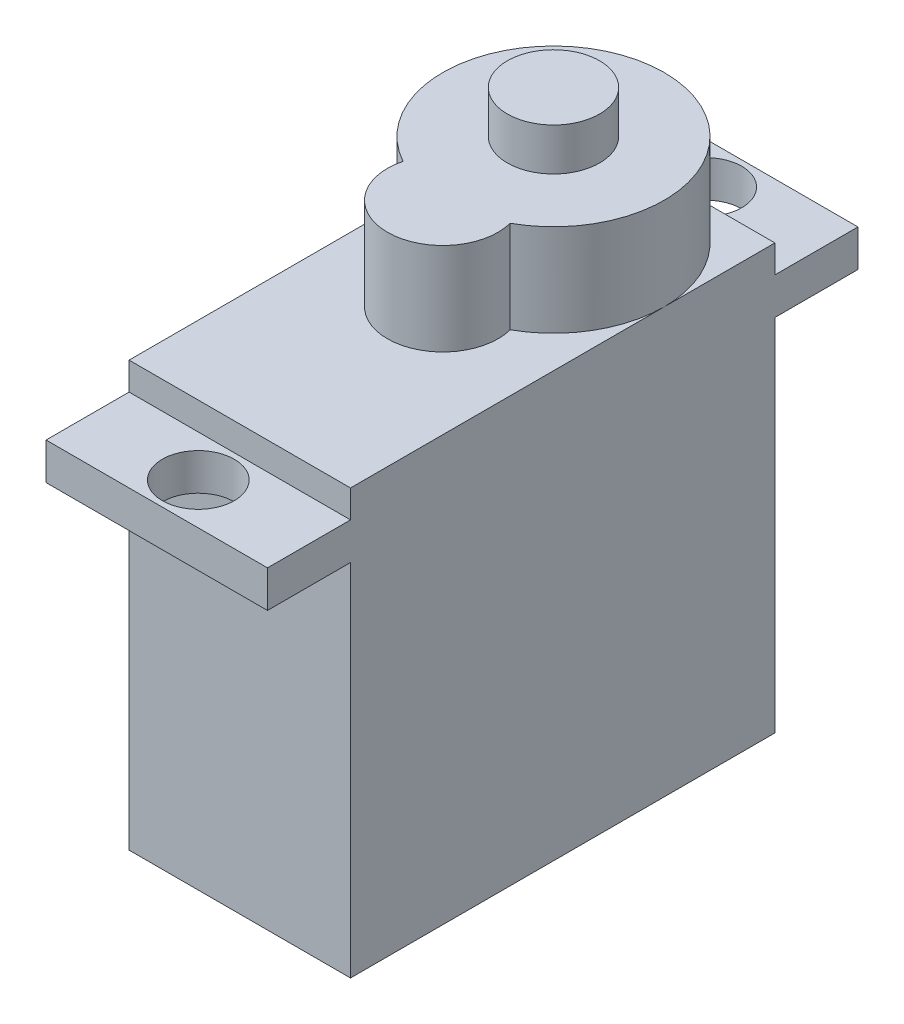
ISO-10303-21;
HEADER;
FILE_DESCRIPTION(('STEP AP214'),'2;1');
FILE_NAME('part.step','',(''),(''),'','','');
FILE_SCHEMA(('AUTOMOTIVE_DESIGN { 1 0 10303 214 1 1 1 1 }'));
ENDSEC;
DATA;
#1=APPLICATION_CONTEXT('core data for automotive mechanical design processes');
#2=APPLICATION_PROTOCOL_DEFINITION('international standard','automotive_design',2000,#1);
#3=PRODUCT_CONTEXT('',#1,'mechanical');
#4=PRODUCT('Part','Part','',(#3));
#5=PRODUCT_RELATED_PRODUCT_CATEGORY('part','',(#4));
#6=PRODUCT_DEFINITION_FORMATION('','',#4);
#7=PRODUCT_DEFINITION_CONTEXT('part definition',#1,'design');
#8=PRODUCT_DEFINITION('design','',#6,#7);
#9=PRODUCT_DEFINITION_SHAPE('','',#8);
#10=(LENGTH_UNIT() NAMED_UNIT(*) SI_UNIT(.MILLI.,.METRE.));
#11=(NAMED_UNIT(*) PLANE_ANGLE_UNIT() SI_UNIT($,.RADIAN.));
#12=(NAMED_UNIT(*) SI_UNIT($,.STERADIAN.) SOLID_ANGLE_UNIT());
#13=UNCERTAINTY_MEASURE_WITH_UNIT(LENGTH_MEASURE(1.E-05),#10,'distance_accuracy_value','');
#14=(GEOMETRIC_REPRESENTATION_CONTEXT(3) GLOBAL_UNCERTAINTY_ASSIGNED_CONTEXT((#13)) GLOBAL_UNIT_ASSIGNED_CONTEXT((#10,
#11,#12)) REPRESENTATION_CONTEXT('',''));
#15=CARTESIAN_POINT('',(0.,0.,0.));
#16=DIRECTION('',(0.,0.,1.));
#17=DIRECTION('',(1.,0.,0.));
#18=AXIS2_PLACEMENT_3D('',#15,#16,#17);
#19=CARTESIAN_POINT('',(0.,3.5,0.));
#20=DIRECTION('',(0.,1.,0.));
#21=DIRECTION('',(0.,0.,1.));
#22=AXIS2_PLACEMENT_3D('',#19,#20,#21);
#23=PLANE('',#22);
#24=CARTESIAN_POINT('',(0.,3.5,6.));
#25=DIRECTION('',(0.,1.,0.));
#26=DIRECTION('',(0.,0.,1.));
#27=AXIS2_PLACEMENT_3D('',#24,#25,#26);
#28=CIRCLE('',#27,3.);
#29=CARTESIAN_POINT('',(-2.90473750965557,3.5,5.25));
#30=VERTEX_POINT('',#29);
#31=CARTESIAN_POINT('',(2.90473750965556,3.5,5.25));
#32=VERTEX_POINT('',#31);
#33=EDGE_CURVE('E161',#30,#32,#28,.T.);
#34=ORIENTED_EDGE('',*,*,#33,.F.);
#35=CARTESIAN_POINT('',(0.,3.5,0.));
#36=DIRECTION('',(0.,1.,0.));
#37=DIRECTION('',(0.,0.,1.));
#38=AXIS2_PLACEMENT_3D('',#35,#36,#37);
#39=CIRCLE('',#38,6.);
#40=CARTESIAN_POINT('',(-6.,3.5,0.));
#41=VERTEX_POINT('',#40);
#42=EDGE_CURVE('E247',#41,#30,#39,.T.);
#43=ORIENTED_EDGE('',*,*,#42,.F.);
#44=DIRECTION('',(0.,0.,1.));
#45=VECTOR('',#44,1.);
#46=CARTESIAN_POINT('',(-6.,3.5,-6.));
#47=LINE('',#46,#45);
#48=CARTESIAN_POINT('',(-5.99999999999999,3.5,17.));
#49=VERTEX_POINT('',#48);
#50=EDGE_CURVE('E218',#41,#49,#47,.T.);
#51=ORIENTED_EDGE('',*,*,#50,.T.);
#52=DIRECTION('',(1.,0.,0.));
#53=VECTOR('',#52,1.);
#54=CARTESIAN_POINT('',(-5.99999999999999,3.5,17.));
#55=LINE('',#54,#53);
#56=CARTESIAN_POINT('',(6.00000000000001,3.5,17.));
#57=VERTEX_POINT('',#56);
#58=EDGE_CURVE('E221',#49,#57,#55,.T.);
#59=ORIENTED_EDGE('',*,*,#58,.T.);
#60=DIRECTION('',(0.,0.,-1.));
#61=VECTOR('',#60,1.);
#62=CARTESIAN_POINT('',(6.,3.5,-6.));
#63=LINE('',#62,#61);
#64=CARTESIAN_POINT('',(6.,3.5,0.));
#65=VERTEX_POINT('',#64);
#66=EDGE_CURVE('E224',#57,#65,#63,.T.);
#67=ORIENTED_EDGE('',*,*,#66,.T.);
#68=EDGE_CURVE('E43',#32,#65,#39,.T.);
#69=ORIENTED_EDGE('',*,*,#68,.F.);
#70=EDGE_LOOP('',(#34,#43,#51,#59,#67,#69));
#71=FACE_BOUND('',#70,.T.);
#72=ADVANCED_FACE('F32',(#71),#23,.T.);
#73=CARTESIAN_POINT('',(0.,3.5,-6.));
#74=VERTEX_POINT('',#73);
#75=EDGE_CURVE('E11',#65,#74,#39,.T.);
#76=ORIENTED_EDGE('',*,*,#75,.F.);
#77=CARTESIAN_POINT('',(6.,3.5,-6.));
#78=VERTEX_POINT('',#77);
#79=EDGE_CURVE('E223',#65,#78,#63,.T.);
#80=ORIENTED_EDGE('',*,*,#79,.T.);
#81=DIRECTION('',(-1.,0.,0.));
#82=VECTOR('',#81,1.);
#83=CARTESIAN_POINT('',(-6.,3.5,-6.));
#84=LINE('',#83,#82);
#85=EDGE_CURVE('E227',#78,#74,#84,.T.);
#86=ORIENTED_EDGE('',*,*,#85,.T.);
#87=EDGE_LOOP('',(#76,#80,#86));
#88=FACE_BOUND('',#87,.T.);
#89=ADVANCED_FACE('F287',(#88),#23,.T.);
#90=CARTESIAN_POINT('',(-5.99999999999999,3.5,17.));
#91=DIRECTION('',(0.,0.,-1.));
#92=DIRECTION('',(-1.,0.,0.));
#93=AXIS2_PLACEMENT_3D('',#90,#91,#92);
#94=PLANE('',#93);
#95=DIRECTION('',(1.,0.,0.));
#96=VECTOR('',#95,1.);
#97=CARTESIAN_POINT('',(-5.99999999999999,0.,17.));
#98=LINE('',#97,#96);
#99=CARTESIAN_POINT('',(-5.99999999999999,0.,17.));
#100=VERTEX_POINT('',#99);
#101=CARTESIAN_POINT('',(6.00000000000001,0.,17.));
#102=VERTEX_POINT('',#101);
#103=EDGE_CURVE('E201',#100,#102,#98,.T.);
#104=ORIENTED_EDGE('',*,*,#103,.F.);
#105=DIRECTION('',(0.,-1.,0.));
#106=VECTOR('',#105,1.);
#107=CARTESIAN_POINT('',(-5.99999999999999,3.5,17.));
#108=LINE('',#107,#106);
#109=CARTESIAN_POINT('',(-5.99999999999999,-19.5,17.));
#110=VERTEX_POINT('',#109);
#111=EDGE_CURVE('E241',#100,#110,#108,.T.);
#112=ORIENTED_EDGE('',*,*,#111,.T.);
#113=DIRECTION('',(1.,0.,0.));
#114=VECTOR('',#113,1.);
#115=CARTESIAN_POINT('',(-5.99999999999999,-19.5,17.));
#116=LINE('',#115,#114);
#117=CARTESIAN_POINT('',(6.00000000000001,-19.5,17.));
#118=VERTEX_POINT('',#117);
#119=EDGE_CURVE('E209',#110,#118,#116,.T.);
#120=ORIENTED_EDGE('',*,*,#119,.T.);
#121=DIRECTION('',(0.,-1.,0.));
#122=VECTOR('',#121,1.);
#123=CARTESIAN_POINT('',(6.00000000000001,3.5,17.));
#124=LINE('',#123,#122);
#125=EDGE_CURVE('E237',#102,#118,#124,.T.);
#126=ORIENTED_EDGE('',*,*,#125,.F.);
#127=EDGE_LOOP('',(#104,#112,#120,#126));
#128=FACE_BOUND('',#127,.T.);
#129=ADVANCED_FACE('F293',(#128),#94,.F.);
#130=CARTESIAN_POINT('',(-6.,3.5,-6.));
#131=DIRECTION('',(0.,0.,1.));
#132=DIRECTION('',(1.,0.,0.));
#133=AXIS2_PLACEMENT_3D('',#130,#131,#132);
#134=PLANE('',#133);
#135=DIRECTION('',(-1.,0.,0.));
#136=VECTOR('',#135,1.);
#137=CARTESIAN_POINT('',(-6.,0.,-6.));
#138=LINE('',#137,#136);
#139=CARTESIAN_POINT('',(6.,0.,-6.));
#140=VERTEX_POINT('',#139);
#141=CARTESIAN_POINT('',(-5.99999999999999,0.,-6.));
#142=VERTEX_POINT('',#141);
#143=EDGE_CURVE('E244',#140,#142,#138,.T.);
#144=ORIENTED_EDGE('',*,*,#143,.F.);
#145=DIRECTION('',(0.,-1.,0.));
#146=VECTOR('',#145,1.);
#147=CARTESIAN_POINT('',(6.,3.5,-6.));
#148=LINE('',#147,#146);
#149=CARTESIAN_POINT('',(6.,-19.5,-6.));
#150=VERTEX_POINT('',#149);
#151=EDGE_CURVE('E234',#140,#150,#148,.T.);
#152=ORIENTED_EDGE('',*,*,#151,.T.);
#153=DIRECTION('',(-1.,0.,0.));
#154=VECTOR('',#153,1.);
#155=CARTESIAN_POINT('',(-6.,-19.5,-6.));
#156=LINE('',#155,#154);
#157=CARTESIAN_POINT('',(-6.,-19.5,-6.));
#158=VERTEX_POINT('',#157);
#159=EDGE_CURVE('E215',#150,#158,#156,.T.);
#160=ORIENTED_EDGE('',*,*,#159,.T.);
#161=DIRECTION('',(0.,-1.,0.));
#162=VECTOR('',#161,1.);
#163=CARTESIAN_POINT('',(-6.,3.5,-6.));
#164=LINE('',#163,#162);
#165=EDGE_CURVE('E230',#142,#158,#164,.T.);
#166=ORIENTED_EDGE('',*,*,#165,.F.);
#167=EDGE_LOOP('',(#144,#152,#160,#166));
#168=FACE_BOUND('',#167,.T.);
#169=ADVANCED_FACE('F307',(#168),#134,.F.);
#170=CARTESIAN_POINT('',(-6.,3.5,-6.));
#171=DIRECTION('',(1.,0.,0.));
#172=DIRECTION('',(0.,0.,-1.));
#173=AXIS2_PLACEMENT_3D('',#170,#171,#172);
#174=PLANE('',#173);
#175=CARTESIAN_POINT('',(-6.,3.5,-6.));
#176=VERTEX_POINT('',#175);
#177=CARTESIAN_POINT('',(-6.,2.,-6.));
#178=VERTEX_POINT('',#177);
#179=EDGE_CURVE('E231',#176,#178,#164,.T.);
#180=ORIENTED_EDGE('',*,*,#179,.T.);
#181=DIRECTION('',(0.,0.,1.));
#182=VECTOR('',#181,1.);
#183=CARTESIAN_POINT('',(-5.99999999999999,2.,-10.5));
#184=LINE('',#183,#182);
#185=CARTESIAN_POINT('',(-5.99999999999999,2.,-10.5));
#186=VERTEX_POINT('',#185);
#187=EDGE_CURVE('E168',#186,#178,#184,.T.);
#188=ORIENTED_EDGE('',*,*,#187,.F.);
#189=DIRECTION('',(0.,-1.,0.));
#190=VECTOR('',#189,1.);
#191=CARTESIAN_POINT('',(-5.99999999999999,2.,-10.5));
#192=LINE('',#191,#190);
#193=CARTESIAN_POINT('',(-5.99999999999999,0.,-10.5));
#194=VERTEX_POINT('',#193);
#195=EDGE_CURVE('E179',#186,#194,#192,.T.);
#196=ORIENTED_EDGE('',*,*,#195,.T.);
#197=DIRECTION('',(0.,0.,1.));
#198=VECTOR('',#197,1.);
#199=CARTESIAN_POINT('',(-5.99999999999999,0.,-10.5));
#200=LINE('',#199,#198);
#201=EDGE_CURVE('E164',#194,#142,#200,.T.);
#202=ORIENTED_EDGE('',*,*,#201,.T.);
#203=ORIENTED_EDGE('',*,*,#165,.T.);
#204=DIRECTION('',(0.,0.,1.));
#205=VECTOR('',#204,1.);
#206=CARTESIAN_POINT('',(-6.,-19.5,-6.));
#207=LINE('',#206,#205);
#208=EDGE_CURVE('E206',#158,#110,#207,.T.);
#209=ORIENTED_EDGE('',*,*,#208,.T.);
#210=ORIENTED_EDGE('',*,*,#111,.F.);
#211=CARTESIAN_POINT('',(-5.99999999999999,0.,21.5));
#212=VERTEX_POINT('',#211);
#213=EDGE_CURVE('E162',#100,#212,#200,.T.);
#214=ORIENTED_EDGE('',*,*,#213,.T.);
#215=DIRECTION('',(0.,-1.,0.));
#216=VECTOR('',#215,1.);
#217=CARTESIAN_POINT('',(-5.99999999999999,2.,21.5));
#218=LINE('',#217,#216);
#219=CARTESIAN_POINT('',(-5.99999999999999,2.,21.5));
#220=VERTEX_POINT('',#219);
#221=EDGE_CURVE('E198',#220,#212,#218,.T.);
#222=ORIENTED_EDGE('',*,*,#221,.F.);
#223=CARTESIAN_POINT('',(-5.99999999999999,2.,17.));
#224=VERTEX_POINT('',#223);
#225=EDGE_CURVE('E172',#224,#220,#184,.T.);
#226=ORIENTED_EDGE('',*,*,#225,.F.);
#227=EDGE_CURVE('E242',#49,#224,#108,.T.);
#228=ORIENTED_EDGE('',*,*,#227,.F.);
#229=ORIENTED_EDGE('',*,*,#50,.F.);
#230=EDGE_CURVE('E219',#176,#41,#47,.T.);
#231=ORIENTED_EDGE('',*,*,#230,.F.);
#232=EDGE_LOOP('',(#180,#188,#196,#202,#203,#209,#210,#214,#222,#226,#228,#229,#231));
#233=FACE_BOUND('',#232,.T.);
#234=ADVANCED_FACE('F34',(#233),#174,.F.);
#235=ORIENTED_EDGE('',*,*,#227,.T.);
#236=DIRECTION('',(1.,0.,0.));
#237=VECTOR('',#236,1.);
#238=CARTESIAN_POINT('',(-5.99999999999999,2.,17.));
#239=LINE('',#238,#237);
#240=CARTESIAN_POINT('',(6.00000000000001,2.,17.));
#241=VERTEX_POINT('',#240);
#242=EDGE_CURVE('E204',#224,#241,#239,.T.);
#243=ORIENTED_EDGE('',*,*,#242,.T.);
#244=EDGE_CURVE('E238',#57,#241,#124,.T.);
#245=ORIENTED_EDGE('',*,*,#244,.F.);
#246=ORIENTED_EDGE('',*,*,#58,.F.);
#247=EDGE_LOOP('',(#235,#243,#245,#246));
#248=FACE_BOUND('',#247,.T.);
#249=ADVANCED_FACE('F311',(#248),#94,.F.);
#250=CARTESIAN_POINT('',(6.,3.5,-6.));
#251=DIRECTION('',(-1.,0.,0.));
#252=DIRECTION('',(0.,0.,1.));
#253=AXIS2_PLACEMENT_3D('',#250,#251,#252);
#254=PLANE('',#253);
#255=ORIENTED_EDGE('',*,*,#244,.T.);
#256=DIRECTION('',(0.,0.,-1.));
#257=VECTOR('',#256,1.);
#258=CARTESIAN_POINT('',(6.00000000000001,2.,-10.5));
#259=LINE('',#258,#257);
#260=CARTESIAN_POINT('',(6.00000000000001,2.,21.5));
#261=VERTEX_POINT('',#260);
#262=EDGE_CURVE('E175',#261,#241,#259,.T.);
#263=ORIENTED_EDGE('',*,*,#262,.F.);
#264=DIRECTION('',(0.,-1.,0.));
#265=VECTOR('',#264,1.);
#266=CARTESIAN_POINT('',(6.00000000000001,2.,21.5));
#267=LINE('',#266,#265);
#268=CARTESIAN_POINT('',(6.00000000000001,0.,21.5));
#269=VERTEX_POINT('',#268);
#270=EDGE_CURVE('E195',#261,#269,#267,.T.);
#271=ORIENTED_EDGE('',*,*,#270,.T.);
#272=DIRECTION('',(0.,0.,-1.));
#273=VECTOR('',#272,1.);
#274=CARTESIAN_POINT('',(6.00000000000001,0.,-10.5));
#275=LINE('',#274,#273);
#276=EDGE_CURVE('E185',#269,#102,#275,.T.);
#277=ORIENTED_EDGE('',*,*,#276,.T.);
#278=ORIENTED_EDGE('',*,*,#125,.T.);
#279=DIRECTION('',(0.,0.,-1.));
#280=VECTOR('',#279,1.);
#281=CARTESIAN_POINT('',(6.,-19.5,-6.));
#282=LINE('',#281,#280);
#283=EDGE_CURVE('E212',#118,#150,#282,.T.);
#284=ORIENTED_EDGE('',*,*,#283,.T.);
#285=ORIENTED_EDGE('',*,*,#151,.F.);
#286=CARTESIAN_POINT('',(6.00000000000001,0.,-10.5));
#287=VERTEX_POINT('',#286);
#288=EDGE_CURVE('E184',#140,#287,#275,.T.);
#289=ORIENTED_EDGE('',*,*,#288,.T.);
#290=DIRECTION('',(0.,-1.,0.));
#291=VECTOR('',#290,1.);
#292=CARTESIAN_POINT('',(6.00000000000001,2.,-10.5));
#293=LINE('',#292,#291);
#294=CARTESIAN_POINT('',(6.00000000000001,2.,-10.5));
#295=VERTEX_POINT('',#294);
#296=EDGE_CURVE('E192',#295,#287,#293,.T.);
#297=ORIENTED_EDGE('',*,*,#296,.F.);
#298=CARTESIAN_POINT('',(6.,2.,-6.));
#299=VERTEX_POINT('',#298);
#300=EDGE_CURVE('E174',#299,#295,#259,.T.);
#301=ORIENTED_EDGE('',*,*,#300,.F.);
#302=EDGE_CURVE('E235',#78,#299,#148,.T.);
#303=ORIENTED_EDGE('',*,*,#302,.F.);
#304=ORIENTED_EDGE('',*,*,#79,.F.);
#305=ORIENTED_EDGE('',*,*,#66,.F.);
#306=EDGE_LOOP('',(#255,#263,#271,#277,#278,#284,#285,#289,#297,#301,#303,#304,#305));
#307=FACE_BOUND('',#306,.T.);
#308=ADVANCED_FACE('F306',(#307),#254,.F.);
#309=ORIENTED_EDGE('',*,*,#302,.T.);
#310=DIRECTION('',(-1.,0.,0.));
#311=VECTOR('',#310,1.);
#312=CARTESIAN_POINT('',(-6.,2.,-6.));
#313=LINE('',#312,#311);
#314=EDGE_CURVE('E246',#299,#178,#313,.T.);
#315=ORIENTED_EDGE('',*,*,#314,.T.);
#316=ORIENTED_EDGE('',*,*,#179,.F.);
#317=EDGE_CURVE('E226',#74,#176,#84,.T.);
#318=ORIENTED_EDGE('',*,*,#317,.F.);
#319=ORIENTED_EDGE('',*,*,#85,.F.);
#320=EDGE_LOOP('',(#309,#315,#316,#318,#319));
#321=FACE_BOUND('',#320,.T.);
#322=ADVANCED_FACE('F299',(#321),#134,.F.);
#323=EDGE_CURVE('E41',#74,#41,#39,.T.);
#324=ORIENTED_EDGE('',*,*,#323,.F.);
#325=ORIENTED_EDGE('',*,*,#317,.T.);
#326=ORIENTED_EDGE('',*,*,#230,.T.);
#327=EDGE_LOOP('',(#324,#325,#326));
#328=FACE_BOUND('',#327,.T.);
#329=ADVANCED_FACE('F289',(#328),#23,.T.);
#330=CARTESIAN_POINT('',(0.,-19.5,0.));
#331=DIRECTION('',(0.,1.,0.));
#332=DIRECTION('',(0.,0.,1.));
#333=AXIS2_PLACEMENT_3D('',#330,#331,#332);
#334=PLANE('',#333);
#335=ORIENTED_EDGE('',*,*,#208,.F.);
#336=ORIENTED_EDGE('',*,*,#159,.F.);
#337=ORIENTED_EDGE('',*,*,#283,.F.);
#338=ORIENTED_EDGE('',*,*,#119,.F.);
#339=EDGE_LOOP('',(#335,#336,#337,#338));
#340=FACE_BOUND('',#339,.T.);
#341=ADVANCED_FACE('F298',(#340),#334,.F.);
#342=CARTESIAN_POINT('',(-5.99999999999999,2.,-10.5));
#343=DIRECTION('',(0.,0.,1.));
#344=DIRECTION('',(1.,0.,0.));
#345=AXIS2_PLACEMENT_3D('',#342,#343,#344);
#346=PLANE('',#345);
#347=DIRECTION('',(-1.,0.,0.));
#348=VECTOR('',#347,1.);
#349=CARTESIAN_POINT('',(-5.99999999999999,0.,-10.5));
#350=LINE('',#349,#348);
#351=EDGE_CURVE('E188',#287,#194,#350,.T.);
#352=ORIENTED_EDGE('',*,*,#351,.T.);
#353=ORIENTED_EDGE('',*,*,#195,.F.);
#354=DIRECTION('',(-1.,0.,0.));
#355=VECTOR('',#354,1.);
#356=CARTESIAN_POINT('',(-5.99999999999999,2.,-10.5));
#357=LINE('',#356,#355);
#358=EDGE_CURVE('E178',#295,#186,#357,.T.);
#359=ORIENTED_EDGE('',*,*,#358,.F.);
#360=ORIENTED_EDGE('',*,*,#296,.T.);
#361=EDGE_LOOP('',(#352,#353,#359,#360));
#362=FACE_BOUND('',#361,.T.);
#363=ADVANCED_FACE('F304',(#362),#346,.F.);
#364=CARTESIAN_POINT('',(0.,0.,0.));
#365=DIRECTION('',(0.,1.,0.));
#366=DIRECTION('',(0.,0.,1.));
#367=AXIS2_PLACEMENT_3D('',#364,#365,#366);
#368=PLANE('',#367);
#369=CARTESIAN_POINT('',(0.,0.,-8.25));
#370=DIRECTION('',(0.,1.,0.));
#371=DIRECTION('',(0.,0.,-1.));
#372=AXIS2_PLACEMENT_3D('',#369,#370,#371);
#373=CIRCLE('',#372,1.95);
#374=CARTESIAN_POINT('',(0.,0.,-10.2));
#375=VERTEX_POINT('',#374);
#376=EDGE_CURVE('E265',#375,#375,#373,.T.);
#377=ORIENTED_EDGE('',*,*,#376,.T.);
#378=EDGE_LOOP('',(#377));
#379=FACE_BOUND('',#378,.T.);
#380=ORIENTED_EDGE('',*,*,#288,.F.);
#381=ORIENTED_EDGE('',*,*,#143,.T.);
#382=ORIENTED_EDGE('',*,*,#201,.F.);
#383=ORIENTED_EDGE('',*,*,#351,.F.);
#384=EDGE_LOOP('',(#380,#381,#382,#383));
#385=FACE_BOUND('',#384,.T.);
#386=ADVANCED_FACE('F330',(#379,#385),#368,.F.);
#387=CARTESIAN_POINT('',(0.,2.,0.));
#388=DIRECTION('',(0.,1.,0.));
#389=DIRECTION('',(0.,0.,1.));
#390=AXIS2_PLACEMENT_3D('',#387,#388,#389);
#391=PLANE('',#390);
#392=CARTESIAN_POINT('',(0.,2.,-8.25));
#393=DIRECTION('',(0.,1.,0.));
#394=DIRECTION('',(0.,0.,1.));
#395=AXIS2_PLACEMENT_3D('',#392,#393,#394);
#396=CIRCLE('',#395,1.95);
#397=CARTESIAN_POINT('',(0.,2.,-6.3));
#398=VERTEX_POINT('',#397);
#399=EDGE_CURVE('E36',#398,#398,#396,.F.);
#400=ORIENTED_EDGE('',*,*,#399,.T.);
#401=EDGE_LOOP('',(#400));
#402=FACE_BOUND('',#401,.T.);
#403=ORIENTED_EDGE('',*,*,#314,.F.);
#404=ORIENTED_EDGE('',*,*,#300,.T.);
#405=ORIENTED_EDGE('',*,*,#358,.T.);
#406=ORIENTED_EDGE('',*,*,#187,.T.);
#407=EDGE_LOOP('',(#403,#404,#405,#406));
#408=FACE_BOUND('',#407,.T.);
#409=ADVANCED_FACE('F272',(#402,#408),#391,.T.);
#410=CARTESIAN_POINT('',(0.,2.,19.25));
#411=DIRECTION('',(0.,1.,0.));
#412=DIRECTION('',(0.,0.,1.));
#413=AXIS2_PLACEMENT_3D('',#410,#411,#412);
#414=CIRCLE('',#413,1.95);
#415=CARTESIAN_POINT('',(0.,2.,21.2));
#416=VERTEX_POINT('',#415);
#417=EDGE_CURVE('E258',#416,#416,#414,.F.);
#418=ORIENTED_EDGE('',*,*,#417,.T.);
#419=EDGE_LOOP('',(#418));
#420=FACE_BOUND('',#419,.T.);
#421=ORIENTED_EDGE('',*,*,#242,.F.);
#422=ORIENTED_EDGE('',*,*,#225,.T.);
#423=DIRECTION('',(1.,0.,0.));
#424=VECTOR('',#423,1.);
#425=CARTESIAN_POINT('',(-5.99999999999999,2.,21.5));
#426=LINE('',#425,#424);
#427=EDGE_CURVE('E171',#220,#261,#426,.T.);
#428=ORIENTED_EDGE('',*,*,#427,.T.);
#429=ORIENTED_EDGE('',*,*,#262,.T.);
#430=EDGE_LOOP('',(#421,#422,#428,#429));
#431=FACE_BOUND('',#430,.T.);
#432=ADVANCED_FACE('F350',(#420,#431),#391,.T.);
#433=CARTESIAN_POINT('',(0.,0.,19.25));
#434=DIRECTION('',(0.,1.,0.));
#435=DIRECTION('',(0.,0.,1.));
#436=AXIS2_PLACEMENT_3D('',#433,#434,#435);
#437=CIRCLE('',#436,1.95);
#438=CARTESIAN_POINT('',(0.,0.,21.2));
#439=VERTEX_POINT('',#438);
#440=EDGE_CURVE('E262',#439,#439,#437,.T.);
#441=ORIENTED_EDGE('',*,*,#440,.T.);
#442=EDGE_LOOP('',(#441));
#443=FACE_BOUND('',#442,.T.);
#444=ORIENTED_EDGE('',*,*,#213,.F.);
#445=ORIENTED_EDGE('',*,*,#103,.T.);
#446=ORIENTED_EDGE('',*,*,#276,.F.);
#447=DIRECTION('',(1.,0.,0.));
#448=VECTOR('',#447,1.);
#449=CARTESIAN_POINT('',(-5.99999999999999,0.,21.5));
#450=LINE('',#449,#448);
#451=EDGE_CURVE('E182',#212,#269,#450,.T.);
#452=ORIENTED_EDGE('',*,*,#451,.F.);
#453=EDGE_LOOP('',(#444,#445,#446,#452));
#454=FACE_BOUND('',#453,.T.);
#455=ADVANCED_FACE('F360',(#443,#454),#368,.F.);
#456=CARTESIAN_POINT('',(-5.99999999999999,2.,21.5));
#457=DIRECTION('',(0.,0.,-1.));
#458=DIRECTION('',(-1.,0.,0.));
#459=AXIS2_PLACEMENT_3D('',#456,#457,#458);
#460=PLANE('',#459);
#461=ORIENTED_EDGE('',*,*,#451,.T.);
#462=ORIENTED_EDGE('',*,*,#270,.F.);
#463=ORIENTED_EDGE('',*,*,#427,.F.);
#464=ORIENTED_EDGE('',*,*,#221,.T.);
#465=EDGE_LOOP('',(#461,#462,#463,#464));
#466=FACE_BOUND('',#465,.T.);
#467=ADVANCED_FACE('F355',(#466),#460,.F.);
#468=CARTESIAN_POINT('',(0.,8.5,6.));
#469=DIRECTION('',(0.,-1.,0.));
#470=DIRECTION('',(0.,0.,-1.));
#471=AXIS2_PLACEMENT_3D('',#468,#469,#470);
#472=CYLINDRICAL_SURFACE('',#471,3.);
#473=ORIENTED_EDGE('',*,*,#33,.T.);
#474=DIRECTION('',(0.,-1.,0.));
#475=VECTOR('',#474,1.);
#476=CARTESIAN_POINT('',(2.90473750965556,8.5,5.25));
#477=LINE('',#476,#475);
#478=CARTESIAN_POINT('',(2.90473750965556,8.5,5.25));
#479=VERTEX_POINT('',#478);
#480=EDGE_CURVE('E148',#479,#32,#477,.T.);
#481=ORIENTED_EDGE('',*,*,#480,.F.);
#482=CARTESIAN_POINT('',(0.,8.5,6.));
#483=DIRECTION('',(0.,1.,0.));
#484=DIRECTION('',(0.,0.,1.));
#485=AXIS2_PLACEMENT_3D('',#482,#483,#484);
#486=CIRCLE('',#485,3.);
#487=CARTESIAN_POINT('',(-2.90473750965557,8.5,5.25));
#488=VERTEX_POINT('',#487);
#489=EDGE_CURVE('E155',#488,#479,#486,.T.);
#490=ORIENTED_EDGE('',*,*,#489,.F.);
#491=DIRECTION('',(0.,-1.,0.));
#492=VECTOR('',#491,1.);
#493=CARTESIAN_POINT('',(-2.90473750965557,8.5,5.25));
#494=LINE('',#493,#492);
#495=EDGE_CURVE('E152',#488,#30,#494,.T.);
#496=ORIENTED_EDGE('',*,*,#495,.T.);
#497=EDGE_LOOP('',(#473,#481,#490,#496));
#498=FACE_BOUND('',#497,.T.);
#499=ADVANCED_FACE('F160',(#498),#472,.T.);
#500=CARTESIAN_POINT('',(0.,8.5,0.));
#501=DIRECTION('',(0.,-1.,0.));
#502=DIRECTION('',(0.,0.,-1.));
#503=AXIS2_PLACEMENT_3D('',#500,#501,#502);
#504=CYLINDRICAL_SURFACE('',#503,6.);
#505=ORIENTED_EDGE('',*,*,#68,.T.);
#506=ORIENTED_EDGE('',*,*,#75,.T.);
#507=ORIENTED_EDGE('',*,*,#323,.T.);
#508=ORIENTED_EDGE('',*,*,#42,.T.);
#509=ORIENTED_EDGE('',*,*,#495,.F.);
#510=CARTESIAN_POINT('',(0.,8.5,0.));
#511=DIRECTION('',(0.,1.,0.));
#512=DIRECTION('',(0.,0.,1.));
#513=AXIS2_PLACEMENT_3D('',#510,#511,#512);
#514=CIRCLE('',#513,6.);
#515=EDGE_CURVE('E144',#479,#488,#514,.T.);
#516=ORIENTED_EDGE('',*,*,#515,.F.);
#517=ORIENTED_EDGE('',*,*,#480,.T.);
#518=EDGE_LOOP('',(#505,#506,#507,#508,#509,#516,#517));
#519=FACE_BOUND('',#518,.T.);
#520=ADVANCED_FACE('F146',(#519),#504,.T.);
#521=CARTESIAN_POINT('',(0.,8.5,3.));
#522=DIRECTION('',(0.,1.,0.));
#523=DIRECTION('',(0.,0.,1.));
#524=AXIS2_PLACEMENT_3D('',#521,#522,#523);
#525=PLANE('',#524);
#526=CARTESIAN_POINT('',(0.,8.5,0.));
#527=DIRECTION('',(0.,1.,0.));
#528=DIRECTION('',(0.,0.,1.));
#529=AXIS2_PLACEMENT_3D('',#526,#527,#528);
#530=CIRCLE('',#529,2.5);
#531=CARTESIAN_POINT('',(0.,8.5,2.5));
#532=VERTEX_POINT('',#531);
#533=EDGE_CURVE('E254',#532,#532,#530,.T.);
#534=ORIENTED_EDGE('',*,*,#533,.F.);
#535=EDGE_LOOP('',(#534));
#536=FACE_BOUND('',#535,.T.);
#537=ORIENTED_EDGE('',*,*,#489,.T.);
#538=ORIENTED_EDGE('',*,*,#515,.T.);
#539=EDGE_LOOP('',(#537,#538));
#540=FACE_BOUND('',#539,.T.);
#541=ADVANCED_FACE('F157',(#536,#540),#525,.T.);
#542=CARTESIAN_POINT('',(0.,10.8,0.));
#543=DIRECTION('',(0.,-1.,0.));
#544=DIRECTION('',(0.,0.,-1.));
#545=AXIS2_PLACEMENT_3D('',#542,#543,#544);
#546=CYLINDRICAL_SURFACE('',#545,2.5);
#547=CARTESIAN_POINT('',(0.,10.8,0.));
#548=DIRECTION('',(0.,1.,0.));
#549=DIRECTION('',(0.,0.,1.));
#550=AXIS2_PLACEMENT_3D('',#547,#548,#549);
#551=CIRCLE('',#550,2.5);
#552=CARTESIAN_POINT('',(0.,10.8,2.5));
#553=VERTEX_POINT('',#552);
#554=EDGE_CURVE('E252',#553,#553,#551,.T.);
#555=ORIENTED_EDGE('',*,*,#554,.F.);
#556=EDGE_LOOP('',(#555));
#557=FACE_BOUND('',#556,.T.);
#558=ORIENTED_EDGE('',*,*,#533,.T.);
#559=EDGE_LOOP('',(#558));
#560=FACE_BOUND('',#559,.T.);
#561=ADVANCED_FACE('F451',(#557,#560),#546,.T.);
#562=CARTESIAN_POINT('',(0.,10.8,0.));
#563=DIRECTION('',(0.,1.,0.));
#564=DIRECTION('',(0.,0.,1.));
#565=AXIS2_PLACEMENT_3D('',#562,#563,#564);
#566=PLANE('',#565);
#567=ORIENTED_EDGE('',*,*,#554,.T.);
#568=EDGE_LOOP('',(#567));
#569=FACE_BOUND('',#568,.T.);
#570=ADVANCED_FACE('F283',(#569),#566,.T.);
#571=CARTESIAN_POINT('',(0.,10.8,19.25));
#572=DIRECTION('',(0.,-1.,0.));
#573=DIRECTION('',(0.,0.,-1.));
#574=AXIS2_PLACEMENT_3D('',#571,#572,#573);
#575=CYLINDRICAL_SURFACE('',#574,1.95);
#576=ORIENTED_EDGE('',*,*,#417,.F.);
#577=EDGE_LOOP('',(#576));
#578=FACE_BOUND('',#577,.T.);
#579=ORIENTED_EDGE('',*,*,#440,.F.);
#580=EDGE_LOOP('',(#579));
#581=FACE_BOUND('',#580,.T.);
#582=ADVANCED_FACE('F278',(#578,#581),#575,.F.);
#583=CARTESIAN_POINT('',(0.,10.8,-8.25));
#584=DIRECTION('',(0.,-1.,0.));
#585=DIRECTION('',(0.,0.,-1.));
#586=AXIS2_PLACEMENT_3D('',#583,#584,#585);
#587=CYLINDRICAL_SURFACE('',#586,1.95);
#588=ORIENTED_EDGE('',*,*,#399,.F.);
#589=EDGE_LOOP('',(#588));
#590=FACE_BOUND('',#589,.T.);
#591=ORIENTED_EDGE('',*,*,#376,.F.);
#592=EDGE_LOOP('',(#591));
#593=FACE_BOUND('',#592,.T.);
#594=ADVANCED_FACE('F275',(#590,#593),#587,.F.);
#595=CLOSED_SHELL('',(#72,#89,#129,#169,#234,#249,#308,#322,#329,#341,#363,#386,#409,#432,#455,
#467,#499,#520,#541,#561,#570,#582,#594));
#596=MANIFOLD_SOLID_BREP('B2',#595);
#597=ADVANCED_BREP_SHAPE_REPRESENTATION('',(#18,#596),#14);
#598=SHAPE_DEFINITION_REPRESENTATION(#9,#597);
ENDSEC;
END-ISO-10303-21;
